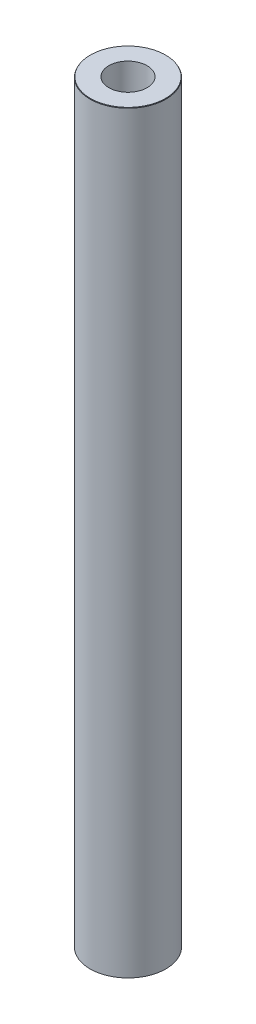
ISO-10303-21;
HEADER;
FILE_DESCRIPTION(('STEP AP214'),'2;1');
FILE_NAME('part.step','',(''),(''),'','','');
FILE_SCHEMA(('AUTOMOTIVE_DESIGN { 1 0 10303 214 1 1 1 1 }'));
ENDSEC;
DATA;
#1=APPLICATION_CONTEXT('core data for automotive mechanical design processes');
#2=APPLICATION_PROTOCOL_DEFINITION('international standard','automotive_design',2000,#1);
#3=PRODUCT_CONTEXT('',#1,'mechanical');
#4=PRODUCT('Part','Part','',(#3));
#5=PRODUCT_RELATED_PRODUCT_CATEGORY('part','',(#4));
#6=PRODUCT_DEFINITION_FORMATION('','',#4);
#7=PRODUCT_DEFINITION_CONTEXT('part definition',#1,'design');
#8=PRODUCT_DEFINITION('design','',#6,#7);
#9=PRODUCT_DEFINITION_SHAPE('','',#8);
#10=(LENGTH_UNIT() NAMED_UNIT(*) SI_UNIT(.MILLI.,.METRE.));
#11=(NAMED_UNIT(*) PLANE_ANGLE_UNIT() SI_UNIT($,.RADIAN.));
#12=(NAMED_UNIT(*) SI_UNIT($,.STERADIAN.) SOLID_ANGLE_UNIT());
#13=UNCERTAINTY_MEASURE_WITH_UNIT(LENGTH_MEASURE(1.E-05),#10,'distance_accuracy_value','');
#14=(GEOMETRIC_REPRESENTATION_CONTEXT(3) GLOBAL_UNCERTAINTY_ASSIGNED_CONTEXT((#13)) GLOBAL_UNIT_ASSIGNED_CONTEXT((#10,
#11,#12)) REPRESENTATION_CONTEXT('',''));
#15=CARTESIAN_POINT('',(0.,0.,0.));
#16=DIRECTION('',(0.,0.,1.));
#17=DIRECTION('',(1.,0.,0.));
#18=AXIS2_PLACEMENT_3D('',#15,#16,#17);
#19=CARTESIAN_POINT('',(0.,298.394476134138,0.));
#20=DIRECTION('',(0.,-1.,0.));
#21=DIRECTION('',(0.,0.,-1.));
#22=AXIS2_PLACEMENT_3D('',#19,#20,#21);
#23=CYLINDRICAL_SURFACE('',#22,15.);
#24=CARTESIAN_POINT('',(0.,298.175427875027,0.));
#25=DIRECTION('',(0.,1.,0.));
#26=DIRECTION('',(0.,0.,1.));
#27=AXIS2_PLACEMENT_3D('',#24,#25,#26);
#28=CIRCLE('',#27,15.);
#29=CARTESIAN_POINT('',(0.,298.175427875027,15.));
#30=VERTEX_POINT('',#29);
#31=EDGE_CURVE('E50',#30,#30,#28,.F.);
#32=ORIENTED_EDGE('',*,*,#31,.T.);
#33=EDGE_LOOP('',(#32));
#34=FACE_BOUND('',#33,.T.);
#35=CARTESIAN_POINT('',(0.,0.126280980102034,0.));
#36=DIRECTION('',(0.,1.,0.));
#37=DIRECTION('',(0.,0.,1.));
#38=AXIS2_PLACEMENT_3D('',#35,#36,#37);
#39=CIRCLE('',#38,15.);
#40=CARTESIAN_POINT('',(0.,0.126280980102034,15.));
#41=VERTEX_POINT('',#40);
#42=EDGE_CURVE('E51',#41,#41,#39,.T.);
#43=ORIENTED_EDGE('',*,*,#42,.T.);
#44=EDGE_LOOP('',(#43));
#45=FACE_BOUND('',#44,.T.);
#46=ADVANCED_FACE('F39',(#34,#45),#23,.T.);
#47=CARTESIAN_POINT('',(0.,298.394476134138,0.));
#48=DIRECTION('',(0.,1.,0.));
#49=DIRECTION('',(0.,0.,1.));
#50=AXIS2_PLACEMENT_3D('',#47,#48,#49);
#51=PLANE('',#50);
#52=CARTESIAN_POINT('',(0.,298.394476134138,0.));
#53=DIRECTION('',(0.,1.,0.));
#54=DIRECTION('',(0.,0.,1.));
#55=AXIS2_PLACEMENT_3D('',#52,#53,#54);
#56=CIRCLE('',#55,14.873719019898);
#57=CARTESIAN_POINT('',(0.,298.394476134138,14.873719019898));
#58=VERTEX_POINT('',#57);
#59=EDGE_CURVE('E54',#58,#58,#56,.T.);
#60=ORIENTED_EDGE('',*,*,#59,.T.);
#61=EDGE_LOOP('',(#60));
#62=FACE_BOUND('',#61,.T.);
#63=CARTESIAN_POINT('',(0.,298.394476134138,0.));
#64=DIRECTION('',(0.,1.,0.));
#65=DIRECTION('',(0.,0.,1.));
#66=AXIS2_PLACEMENT_3D('',#63,#64,#65);
#67=CIRCLE('',#66,7.56984880360197);
#68=CARTESIAN_POINT('',(0.,298.394476134138,7.56984880360197));
#69=VERTEX_POINT('',#68);
#70=EDGE_CURVE('E58',#69,#69,#67,.T.);
#71=ORIENTED_EDGE('',*,*,#70,.F.);
#72=EDGE_LOOP('',(#71));
#73=FACE_BOUND('',#72,.T.);
#74=ADVANCED_FACE('F69',(#62,#73),#51,.T.);
#75=CARTESIAN_POINT('',(0.,0.,0.));
#76=DIRECTION('',(0.,1.,0.));
#77=DIRECTION('',(0.,0.,1.));
#78=AXIS2_PLACEMENT_3D('',#75,#76,#77);
#79=PLANE('',#78);
#80=CARTESIAN_POINT('',(0.,0.,0.));
#81=DIRECTION('',(0.,1.,0.));
#82=DIRECTION('',(0.,0.,1.));
#83=AXIS2_PLACEMENT_3D('',#80,#81,#82);
#84=CIRCLE('',#83,14.7809517408888);
#85=CARTESIAN_POINT('',(0.,0.,14.7809517408888));
#86=VERTEX_POINT('',#85);
#87=EDGE_CURVE('E10',#86,#86,#84,.F.);
#88=ORIENTED_EDGE('',*,*,#87,.T.);
#89=EDGE_LOOP('',(#88));
#90=FACE_BOUND('',#89,.T.);
#91=CARTESIAN_POINT('',(0.,0.,0.));
#92=DIRECTION('',(0.,1.,0.));
#93=DIRECTION('',(0.,0.,1.));
#94=AXIS2_PLACEMENT_3D('',#91,#92,#93);
#95=CIRCLE('',#94,7.56984880360197);
#96=CARTESIAN_POINT('',(0.,0.,7.56984880360197));
#97=VERTEX_POINT('',#96);
#98=EDGE_CURVE('E63',#97,#97,#95,.T.);
#99=ORIENTED_EDGE('',*,*,#98,.T.);
#100=EDGE_LOOP('',(#99));
#101=FACE_BOUND('',#100,.T.);
#102=ADVANCED_FACE('F75',(#90,#101),#79,.F.);
#103=CARTESIAN_POINT('',(0.,298.394476134138,0.));
#104=DIRECTION('',(0.,-1.,0.));
#105=DIRECTION('',(0.,0.,-1.));
#106=AXIS2_PLACEMENT_3D('',#103,#104,#105);
#107=CYLINDRICAL_SURFACE('',#106,7.56984880360197);
#108=ORIENTED_EDGE('',*,*,#70,.T.);
#109=EDGE_LOOP('',(#108));
#110=FACE_BOUND('',#109,.T.);
#111=ORIENTED_EDGE('',*,*,#98,.F.);
#112=EDGE_LOOP('',(#111));
#113=FACE_BOUND('',#112,.T.);
#114=ADVANCED_FACE('F70',(#110,#113),#107,.F.);
#115=CARTESIAN_POINT('',(0.,298.394476134138,0.));
#116=DIRECTION('',(0.,-1.,0.));
#117=DIRECTION('',(0.,0.,-1.));
#118=AXIS2_PLACEMENT_3D('',#115,#116,#117);
#119=CONICAL_SURFACE('',#118,14.873719019898,0.522959669563058);
#120=ORIENTED_EDGE('',*,*,#31,.F.);
#121=EDGE_LOOP('',(#120));
#122=FACE_BOUND('',#121,.T.);
#123=ORIENTED_EDGE('',*,*,#59,.F.);
#124=EDGE_LOOP('',(#123));
#125=FACE_BOUND('',#124,.T.);
#126=ADVANCED_FACE('F81',(#122,#125),#119,.T.);
#127=CARTESIAN_POINT('',(0.,0.126280980102034,0.));
#128=DIRECTION('',(0.,1.,0.));
#129=DIRECTION('',(0.,0.,1.));
#130=AXIS2_PLACEMENT_3D('',#127,#128,#129);
#131=CONICAL_SURFACE('',#130,15.,1.04783665723176);
#132=ORIENTED_EDGE('',*,*,#87,.F.);
#133=EDGE_LOOP('',(#132));
#134=FACE_BOUND('',#133,.T.);
#135=ORIENTED_EDGE('',*,*,#42,.F.);
#136=EDGE_LOOP('',(#135));
#137=FACE_BOUND('',#136,.T.);
#138=ADVANCED_FACE('F45',(#134,#137),#131,.T.);
#139=CLOSED_SHELL('',(#46,#74,#102,#114,#126,#138));
#140=MANIFOLD_SOLID_BREP('B2',#139);
#141=ADVANCED_BREP_SHAPE_REPRESENTATION('',(#18,#140),#14);
#142=SHAPE_DEFINITION_REPRESENTATION(#9,#141);
ENDSEC;
END-ISO-10303-21;
